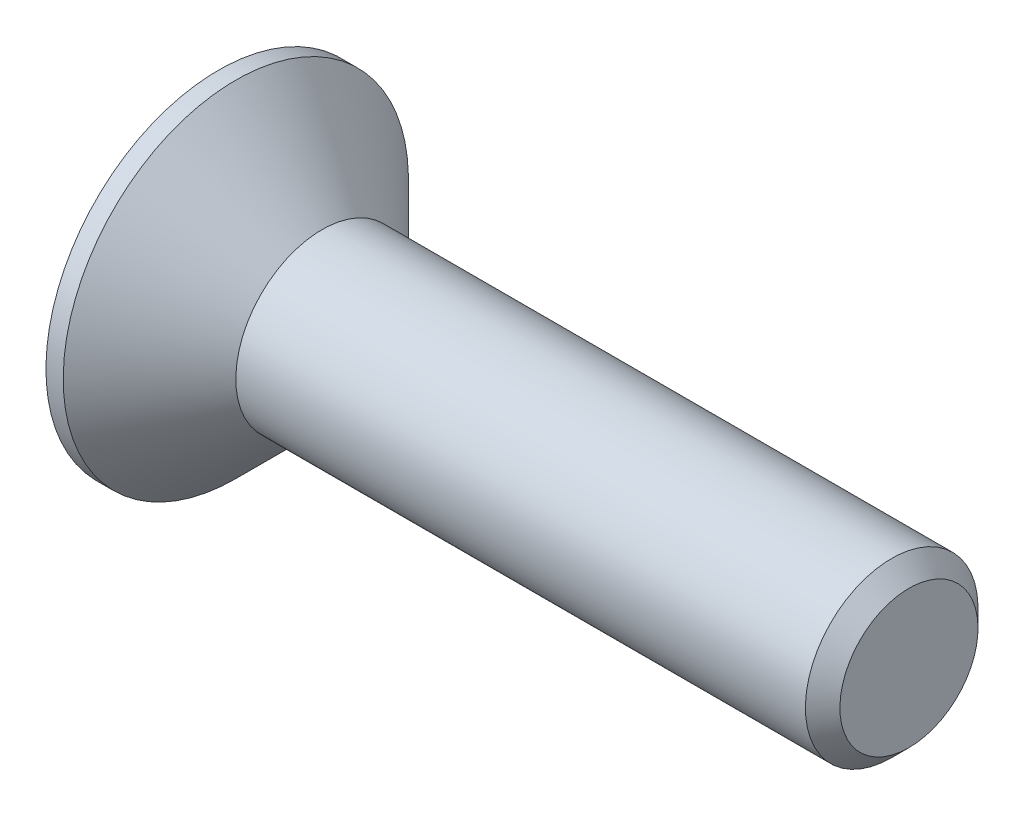
ISO-10303-21;
HEADER;
FILE_DESCRIPTION(('STEP AP214'),'2;1');
FILE_NAME('part.step','',(''),(''),'','','');
FILE_SCHEMA(('AUTOMOTIVE_DESIGN { 1 0 10303 214 1 1 1 1 }'));
ENDSEC;
DATA;
#1=APPLICATION_CONTEXT('core data for automotive mechanical design processes');
#2=APPLICATION_PROTOCOL_DEFINITION('international standard','automotive_design',2000,#1);
#3=PRODUCT_CONTEXT('',#1,'mechanical');
#4=PRODUCT('Part','Part','',(#3));
#5=PRODUCT_RELATED_PRODUCT_CATEGORY('part','',(#4));
#6=PRODUCT_DEFINITION_FORMATION('','',#4);
#7=PRODUCT_DEFINITION_CONTEXT('part definition',#1,'design');
#8=PRODUCT_DEFINITION('design','',#6,#7);
#9=PRODUCT_DEFINITION_SHAPE('','',#8);
#10=(LENGTH_UNIT() NAMED_UNIT(*) SI_UNIT(.MILLI.,.METRE.));
#11=(NAMED_UNIT(*) PLANE_ANGLE_UNIT() SI_UNIT($,.RADIAN.));
#12=(NAMED_UNIT(*) SI_UNIT($,.STERADIAN.) SOLID_ANGLE_UNIT());
#13=UNCERTAINTY_MEASURE_WITH_UNIT(LENGTH_MEASURE(1.E-05),#10,'distance_accuracy_value','');
#14=(GEOMETRIC_REPRESENTATION_CONTEXT(3) GLOBAL_UNCERTAINTY_ASSIGNED_CONTEXT((#13)) GLOBAL_UNIT_ASSIGNED_CONTEXT((#10,
#11,#12)) REPRESENTATION_CONTEXT('',''));
#15=CARTESIAN_POINT('',(0.,0.,0.));
#16=DIRECTION('',(0.,0.,1.));
#17=DIRECTION('',(1.,0.,0.));
#18=AXIS2_PLACEMENT_3D('',#15,#16,#17);
#19=CARTESIAN_POINT('',(-1.2,0.,0.));
#20=DIRECTION('',(-1.,0.,0.));
#21=DIRECTION('',(0.,-1.,0.));
#22=AXIS2_PLACEMENT_3D('',#19,#20,#21);
#23=CYLINDRICAL_SURFACE('',#22,0.999999999999999);
#24=CARTESIAN_POINT('',(6.6,0.,0.));
#25=DIRECTION('',(-1.,0.,0.));
#26=DIRECTION('',(0.,-1.,0.));
#27=AXIS2_PLACEMENT_3D('',#24,#25,#26);
#28=CIRCLE('',#27,0.999999999999999);
#29=CARTESIAN_POINT('',(6.6,-0.999999999999999,0.));
#30=VERTEX_POINT('',#29);
#31=EDGE_CURVE('E45',#30,#30,#28,.T.);
#32=ORIENTED_EDGE('',*,*,#31,.T.);
#33=EDGE_LOOP('',(#32));
#34=FACE_BOUND('',#33,.T.);
#35=CARTESIAN_POINT('',(0.,0.,0.));
#36=DIRECTION('',(-1.,0.,0.));
#37=DIRECTION('',(0.,-1.,0.));
#38=AXIS2_PLACEMENT_3D('',#35,#36,#37);
#39=CIRCLE('',#38,1.);
#40=CARTESIAN_POINT('',(0.,-1.,0.));
#41=VERTEX_POINT('',#40);
#42=EDGE_CURVE('E150',#41,#41,#39,.T.);
#43=ORIENTED_EDGE('',*,*,#42,.F.);
#44=EDGE_LOOP('',(#43));
#45=FACE_BOUND('',#44,.T.);
#46=ADVANCED_FACE('F37',(#34,#45),#23,.T.);
#47=CARTESIAN_POINT('',(0.,0.,0.));
#48=DIRECTION('',(-1.,0.,0.));
#49=DIRECTION('',(0.,-1.,0.));
#50=AXIS2_PLACEMENT_3D('',#47,#48,#49);
#51=CONICAL_SURFACE('',#50,1.,0.785398163397443);
#52=CARTESIAN_POINT('',(-1.00000000000001,0.,0.));
#53=DIRECTION('',(-1.,0.,0.));
#54=DIRECTION('',(0.,-1.,0.));
#55=AXIS2_PLACEMENT_3D('',#52,#53,#54);
#56=CIRCLE('',#55,2.);
#57=CARTESIAN_POINT('',(-1.00000000000001,-2.,0.));
#58=VERTEX_POINT('',#57);
#59=EDGE_CURVE('E147',#58,#58,#56,.T.);
#60=ORIENTED_EDGE('',*,*,#59,.F.);
#61=EDGE_LOOP('',(#60));
#62=FACE_BOUND('',#61,.T.);
#63=ORIENTED_EDGE('',*,*,#42,.T.);
#64=EDGE_LOOP('',(#63));
#65=FACE_BOUND('',#64,.T.);
#66=ADVANCED_FACE('F172',(#62,#65),#51,.T.);
#67=CARTESIAN_POINT('',(-1.2,0.,0.));
#68=DIRECTION('',(-1.,0.,0.));
#69=DIRECTION('',(0.,-1.,0.));
#70=AXIS2_PLACEMENT_3D('',#67,#68,#69);
#71=CYLINDRICAL_SURFACE('',#70,2.);
#72=CARTESIAN_POINT('',(-1.2,0.,0.));
#73=DIRECTION('',(-1.,0.,0.));
#74=DIRECTION('',(0.,-1.,0.));
#75=AXIS2_PLACEMENT_3D('',#72,#73,#74);
#76=CIRCLE('',#75,2.);
#77=CARTESIAN_POINT('',(-1.2,-2.,0.));
#78=VERTEX_POINT('',#77);
#79=EDGE_CURVE('E139',#78,#78,#76,.T.);
#80=ORIENTED_EDGE('',*,*,#79,.F.);
#81=EDGE_LOOP('',(#80));
#82=FACE_BOUND('',#81,.T.);
#83=ORIENTED_EDGE('',*,*,#59,.T.);
#84=EDGE_LOOP('',(#83));
#85=FACE_BOUND('',#84,.T.);
#86=ADVANCED_FACE('F176',(#82,#85),#71,.T.);
#87=CARTESIAN_POINT('',(-1.2,2.,0.));
#88=DIRECTION('',(1.,0.,0.));
#89=DIRECTION('',(0.,1.,0.));
#90=AXIS2_PLACEMENT_3D('',#87,#88,#89);
#91=PLANE('',#90);
#92=DIRECTION('',(0.,-0.866025403784439,0.5));
#93=VECTOR('',#92,1.);
#94=CARTESIAN_POINT('',(-1.2,0.,-0.750555349946514));
#95=LINE('',#94,#93);
#96=CARTESIAN_POINT('',(-1.2,0.,-0.750555349946513));
#97=VERTEX_POINT('',#96);
#98=CARTESIAN_POINT('',(-1.2,-0.65,-0.375277674973257));
#99=VERTEX_POINT('',#98);
#100=EDGE_CURVE('E126',#97,#99,#95,.T.);
#101=ORIENTED_EDGE('',*,*,#100,.F.);
#102=DIRECTION('',(0.,-0.866025403784438,-0.5));
#103=VECTOR('',#102,1.);
#104=CARTESIAN_POINT('',(-1.2,0.65,-0.375277674973257));
#105=LINE('',#104,#103);
#106=CARTESIAN_POINT('',(-1.2,0.65,-0.375277674973257));
#107=VERTEX_POINT('',#106);
#108=EDGE_CURVE('E52',#107,#97,#105,.T.);
#109=ORIENTED_EDGE('',*,*,#108,.F.);
#110=DIRECTION('',(0.,0.,-1.));
#111=VECTOR('',#110,1.);
#112=CARTESIAN_POINT('',(-1.2,0.65,0.375277674973257));
#113=LINE('',#112,#111);
#114=CARTESIAN_POINT('',(-1.2,0.65,0.375277674973257));
#115=VERTEX_POINT('',#114);
#116=EDGE_CURVE('E135',#115,#107,#113,.T.);
#117=ORIENTED_EDGE('',*,*,#116,.F.);
#118=DIRECTION('',(0.,0.866025403784439,-0.5));
#119=VECTOR('',#118,1.);
#120=CARTESIAN_POINT('',(-1.2,0.,0.750555349946513));
#121=LINE('',#120,#119);
#122=CARTESIAN_POINT('',(-1.2,0.,0.750555349946513));
#123=VERTEX_POINT('',#122);
#124=EDGE_CURVE('E133',#123,#115,#121,.T.);
#125=ORIENTED_EDGE('',*,*,#124,.F.);
#126=DIRECTION('',(0.,0.866025403784439,0.5));
#127=VECTOR('',#126,1.);
#128=CARTESIAN_POINT('',(-1.2,-0.65,0.375277674973257));
#129=LINE('',#128,#127);
#130=CARTESIAN_POINT('',(-1.2,-0.65,0.375277674973257));
#131=VERTEX_POINT('',#130);
#132=EDGE_CURVE('E100',#131,#123,#129,.T.);
#133=ORIENTED_EDGE('',*,*,#132,.F.);
#134=DIRECTION('',(0.,0.,1.));
#135=VECTOR('',#134,1.);
#136=CARTESIAN_POINT('',(-1.2,-0.65,-0.375277674973257));
#137=LINE('',#136,#135);
#138=EDGE_CURVE('E129',#99,#131,#137,.T.);
#139=ORIENTED_EDGE('',*,*,#138,.F.);
#140=EDGE_LOOP('',(#101,#109,#117,#125,#133,#139));
#141=FACE_BOUND('',#140,.T.);
#142=ORIENTED_EDGE('',*,*,#79,.T.);
#143=EDGE_LOOP('',(#142));
#144=FACE_BOUND('',#143,.T.);
#145=ADVANCED_FACE('F167',(#141,#144),#91,.F.);
#146=CARTESIAN_POINT('',(6.8,0.,0.));
#147=DIRECTION('',(-1.,0.,0.));
#148=DIRECTION('',(0.,-1.,0.));
#149=AXIS2_PLACEMENT_3D('',#146,#147,#148);
#150=PLANE('',#149);
#151=CARTESIAN_POINT('',(6.8,0.,0.));
#152=DIRECTION('',(-1.,0.,0.));
#153=DIRECTION('',(0.,-1.,0.));
#154=AXIS2_PLACEMENT_3D('',#151,#152,#153);
#155=CIRCLE('',#154,0.8);
#156=CARTESIAN_POINT('',(6.8,-0.8,0.));
#157=VERTEX_POINT('',#156);
#158=EDGE_CURVE('E11',#157,#157,#155,.F.);
#159=ORIENTED_EDGE('',*,*,#158,.T.);
#160=EDGE_LOOP('',(#159));
#161=FACE_BOUND('',#160,.T.);
#162=ADVANCED_FACE('F159',(#161),#150,.F.);
#163=CARTESIAN_POINT('',(6.6,0.,0.));
#164=DIRECTION('',(-1.,0.,0.));
#165=DIRECTION('',(0.,-1.,0.));
#166=AXIS2_PLACEMENT_3D('',#163,#164,#165);
#167=CONICAL_SURFACE('',#166,0.999999999999999,0.78539816339745);
#168=ORIENTED_EDGE('',*,*,#158,.F.);
#169=EDGE_LOOP('',(#168));
#170=FACE_BOUND('',#169,.T.);
#171=ORIENTED_EDGE('',*,*,#31,.F.);
#172=EDGE_LOOP('',(#171));
#173=FACE_BOUND('',#172,.T.);
#174=ADVANCED_FACE('F39',(#170,#173),#167,.T.);
#175=CARTESIAN_POINT('',(-0.45,0.65,-0.375277674973257));
#176=DIRECTION('',(0.,0.5,-0.866025403784439));
#177=DIRECTION('',(0.,0.866025403784439,0.5));
#178=AXIS2_PLACEMENT_3D('',#175,#176,#177);
#179=PLANE('',#178);
#180=ORIENTED_EDGE('',*,*,#108,.T.);
#181=DIRECTION('',(-1.,0.,0.));
#182=VECTOR('',#181,1.);
#183=CARTESIAN_POINT('',(-0.45,0.,-0.750555349946514));
#184=LINE('',#183,#182);
#185=CARTESIAN_POINT('',(-0.45,0.,-0.750555349946514));
#186=VERTEX_POINT('',#185);
#187=EDGE_CURVE('E82',#186,#97,#184,.T.);
#188=ORIENTED_EDGE('',*,*,#187,.F.);
#189=DIRECTION('',(0.,-0.866025403784438,-0.5));
#190=VECTOR('',#189,1.);
#191=CARTESIAN_POINT('',(-0.45,0.65,-0.375277674973257));
#192=LINE('',#191,#190);
#193=CARTESIAN_POINT('',(-0.45,0.65,-0.375277674973257));
#194=VERTEX_POINT('',#193);
#195=EDGE_CURVE('E137',#194,#186,#192,.T.);
#196=ORIENTED_EDGE('',*,*,#195,.F.);
#197=DIRECTION('',(-1.,0.,0.));
#198=VECTOR('',#197,1.);
#199=CARTESIAN_POINT('',(-0.45,0.65,-0.375277674973257));
#200=LINE('',#199,#198);
#201=EDGE_CURVE('E60',#194,#107,#200,.T.);
#202=ORIENTED_EDGE('',*,*,#201,.T.);
#203=EDGE_LOOP('',(#180,#188,#196,#202));
#204=FACE_BOUND('',#203,.T.);
#205=ADVANCED_FACE('F158',(#204),#179,.F.);
#206=CARTESIAN_POINT('',(-0.45,0.65,0.375277674973257));
#207=DIRECTION('',(0.,1.,0.));
#208=DIRECTION('',(0.,0.,1.));
#209=AXIS2_PLACEMENT_3D('',#206,#207,#208);
#210=PLANE('',#209);
#211=ORIENTED_EDGE('',*,*,#116,.T.);
#212=ORIENTED_EDGE('',*,*,#201,.F.);
#213=DIRECTION('',(0.,0.,-1.));
#214=VECTOR('',#213,1.);
#215=CARTESIAN_POINT('',(-0.45,0.65,0.375277674973257));
#216=LINE('',#215,#214);
#217=CARTESIAN_POINT('',(-0.45,0.65,0.375277674973257));
#218=VERTEX_POINT('',#217);
#219=EDGE_CURVE('E112',#218,#194,#216,.T.);
#220=ORIENTED_EDGE('',*,*,#219,.F.);
#221=DIRECTION('',(-1.,0.,0.));
#222=VECTOR('',#221,1.);
#223=CARTESIAN_POINT('',(-0.45,0.65,0.375277674973257));
#224=LINE('',#223,#222);
#225=EDGE_CURVE('E104',#218,#115,#224,.T.);
#226=ORIENTED_EDGE('',*,*,#225,.T.);
#227=EDGE_LOOP('',(#211,#212,#220,#226));
#228=FACE_BOUND('',#227,.T.);
#229=ADVANCED_FACE('F165',(#228),#210,.F.);
#230=CARTESIAN_POINT('',(-0.45,0.,0.750555349946513));
#231=DIRECTION('',(0.,0.5,0.866025403784439));
#232=DIRECTION('',(0.,-0.866025403784439,0.5));
#233=AXIS2_PLACEMENT_3D('',#230,#231,#232);
#234=PLANE('',#233);
#235=ORIENTED_EDGE('',*,*,#124,.T.);
#236=ORIENTED_EDGE('',*,*,#225,.F.);
#237=DIRECTION('',(0.,0.866025403784439,-0.5));
#238=VECTOR('',#237,1.);
#239=CARTESIAN_POINT('',(-0.45,0.,0.750555349946513));
#240=LINE('',#239,#238);
#241=CARTESIAN_POINT('',(-0.45,0.,0.750555349946513));
#242=VERTEX_POINT('',#241);
#243=EDGE_CURVE('E108',#242,#218,#240,.T.);
#244=ORIENTED_EDGE('',*,*,#243,.F.);
#245=DIRECTION('',(-1.,0.,0.));
#246=VECTOR('',#245,1.);
#247=CARTESIAN_POINT('',(-0.45,0.,0.750555349946513));
#248=LINE('',#247,#246);
#249=EDGE_CURVE('E93',#242,#123,#248,.T.);
#250=ORIENTED_EDGE('',*,*,#249,.T.);
#251=EDGE_LOOP('',(#235,#236,#244,#250));
#252=FACE_BOUND('',#251,.T.);
#253=ADVANCED_FACE('F109',(#252),#234,.F.);
#254=CARTESIAN_POINT('',(-0.45,-0.65,0.375277674973257));
#255=DIRECTION('',(0.,-0.5,0.866025403784439));
#256=DIRECTION('',(0.,-0.866025403784439,-0.5));
#257=AXIS2_PLACEMENT_3D('',#254,#255,#256);
#258=PLANE('',#257);
#259=ORIENTED_EDGE('',*,*,#132,.T.);
#260=ORIENTED_EDGE('',*,*,#249,.F.);
#261=DIRECTION('',(0.,0.866025403784439,0.5));
#262=VECTOR('',#261,1.);
#263=CARTESIAN_POINT('',(-0.45,-0.65,0.375277674973257));
#264=LINE('',#263,#262);
#265=CARTESIAN_POINT('',(-0.45,-0.65,0.375277674973257));
#266=VERTEX_POINT('',#265);
#267=EDGE_CURVE('E97',#266,#242,#264,.T.);
#268=ORIENTED_EDGE('',*,*,#267,.F.);
#269=DIRECTION('',(-1.,0.,0.));
#270=VECTOR('',#269,1.);
#271=CARTESIAN_POINT('',(-0.45,-0.65,0.375277674973257));
#272=LINE('',#271,#270);
#273=EDGE_CURVE('E105',#266,#131,#272,.T.);
#274=ORIENTED_EDGE('',*,*,#273,.T.);
#275=EDGE_LOOP('',(#259,#260,#268,#274));
#276=FACE_BOUND('',#275,.T.);
#277=ADVANCED_FACE('F95',(#276),#258,.F.);
#278=CARTESIAN_POINT('',(-0.45,-0.65,-0.375277674973257));
#279=DIRECTION('',(0.,-1.,0.));
#280=DIRECTION('',(0.,0.,-1.));
#281=AXIS2_PLACEMENT_3D('',#278,#279,#280);
#282=PLANE('',#281);
#283=ORIENTED_EDGE('',*,*,#138,.T.);
#284=ORIENTED_EDGE('',*,*,#273,.F.);
#285=DIRECTION('',(0.,0.,1.));
#286=VECTOR('',#285,1.);
#287=CARTESIAN_POINT('',(-0.45,-0.65,-0.375277674973257));
#288=LINE('',#287,#286);
#289=CARTESIAN_POINT('',(-0.45,-0.65,-0.375277674973257));
#290=VERTEX_POINT('',#289);
#291=EDGE_CURVE('E118',#290,#266,#288,.T.);
#292=ORIENTED_EDGE('',*,*,#291,.F.);
#293=DIRECTION('',(-1.,0.,0.));
#294=VECTOR('',#293,1.);
#295=CARTESIAN_POINT('',(-0.45,-0.65,-0.375277674973257));
#296=LINE('',#295,#294);
#297=EDGE_CURVE('E142',#290,#99,#296,.T.);
#298=ORIENTED_EDGE('',*,*,#297,.T.);
#299=EDGE_LOOP('',(#283,#284,#292,#298));
#300=FACE_BOUND('',#299,.T.);
#301=ADVANCED_FACE('F189',(#300),#282,.F.);
#302=CARTESIAN_POINT('',(-0.45,0.,-0.750555349946514));
#303=DIRECTION('',(0.,-0.5,-0.866025403784439));
#304=DIRECTION('',(0.,0.866025403784439,-0.5));
#305=AXIS2_PLACEMENT_3D('',#302,#303,#304);
#306=PLANE('',#305);
#307=ORIENTED_EDGE('',*,*,#100,.T.);
#308=ORIENTED_EDGE('',*,*,#297,.F.);
#309=DIRECTION('',(0.,-0.866025403784439,0.5));
#310=VECTOR('',#309,1.);
#311=CARTESIAN_POINT('',(-0.45,0.,-0.750555349946514));
#312=LINE('',#311,#310);
#313=EDGE_CURVE('E120',#186,#290,#312,.T.);
#314=ORIENTED_EDGE('',*,*,#313,.F.);
#315=ORIENTED_EDGE('',*,*,#187,.T.);
#316=EDGE_LOOP('',(#307,#308,#314,#315));
#317=FACE_BOUND('',#316,.T.);
#318=ADVANCED_FACE('F186',(#317),#306,.F.);
#319=CARTESIAN_POINT('',(-0.45,0.,0.));
#320=DIRECTION('',(-1.,0.,0.));
#321=DIRECTION('',(0.,0.,1.));
#322=AXIS2_PLACEMENT_3D('',#319,#320,#321);
#323=PLANE('',#322);
#324=ORIENTED_EDGE('',*,*,#195,.T.);
#325=ORIENTED_EDGE('',*,*,#313,.T.);
#326=ORIENTED_EDGE('',*,*,#291,.T.);
#327=ORIENTED_EDGE('',*,*,#267,.T.);
#328=ORIENTED_EDGE('',*,*,#243,.T.);
#329=ORIENTED_EDGE('',*,*,#219,.T.);
#330=EDGE_LOOP('',(#324,#325,#326,#327,#328,#329));
#331=FACE_BOUND('',#330,.T.);
#332=ADVANCED_FACE('F115',(#331),#323,.T.);
#333=CLOSED_SHELL('',(#46,#66,#86,#145,#162,#174,#205,#229,#253,#277,#301,#318,#332));
#334=MANIFOLD_SOLID_BREP('B2',#333);
#335=ADVANCED_BREP_SHAPE_REPRESENTATION('',(#18,#334),#14);
#336=SHAPE_DEFINITION_REPRESENTATION(#9,#335);
ENDSEC;
END-ISO-10303-21;
